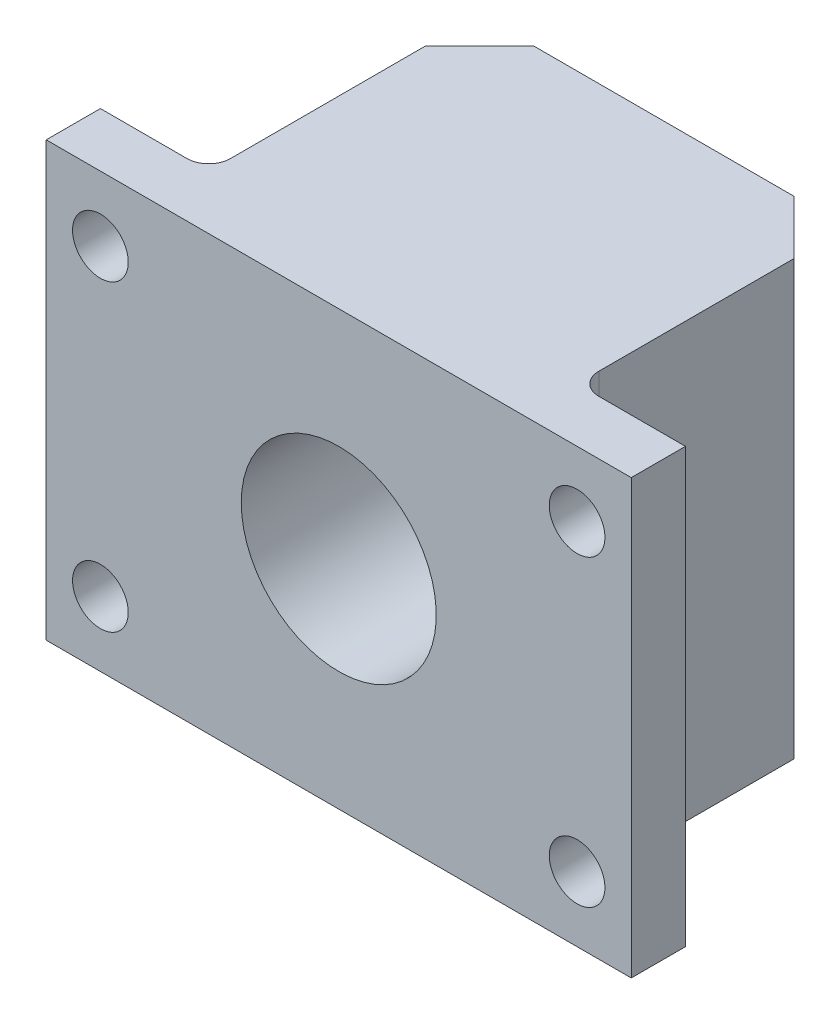
ISO-10303-21;
HEADER;
FILE_DESCRIPTION(('STEP AP214'),'2;1');
FILE_NAME('part.step','',(''),(''),'','','');
FILE_SCHEMA(('AUTOMOTIVE_DESIGN { 1 0 10303 214 1 1 1 1 }'));
ENDSEC;
DATA;
#1=APPLICATION_CONTEXT('core data for automotive mechanical design processes');
#2=APPLICATION_PROTOCOL_DEFINITION('international standard','automotive_design',2000,#1);
#3=PRODUCT_CONTEXT('',#1,'mechanical');
#4=PRODUCT('Part','Part','',(#3));
#5=PRODUCT_RELATED_PRODUCT_CATEGORY('part','',(#4));
#6=PRODUCT_DEFINITION_FORMATION('','',#4);
#7=PRODUCT_DEFINITION_CONTEXT('part definition',#1,'design');
#8=PRODUCT_DEFINITION('design','',#6,#7);
#9=PRODUCT_DEFINITION_SHAPE('','',#8);
#10=(LENGTH_UNIT() NAMED_UNIT(*) SI_UNIT(.MILLI.,.METRE.));
#11=(NAMED_UNIT(*) PLANE_ANGLE_UNIT() SI_UNIT($,.RADIAN.));
#12=(NAMED_UNIT(*) SI_UNIT($,.STERADIAN.) SOLID_ANGLE_UNIT());
#13=UNCERTAINTY_MEASURE_WITH_UNIT(LENGTH_MEASURE(1.E-05),#10,'distance_accuracy_value','');
#14=(GEOMETRIC_REPRESENTATION_CONTEXT(3) GLOBAL_UNCERTAINTY_ASSIGNED_CONTEXT((#13)) GLOBAL_UNIT_ASSIGNED_CONTEXT((#10,
#11,#12)) REPRESENTATION_CONTEXT('',''));
#15=CARTESIAN_POINT('',(0.,0.,0.));
#16=DIRECTION('',(0.,0.,1.));
#17=DIRECTION('',(1.,0.,0.));
#18=AXIS2_PLACEMENT_3D('',#15,#16,#17);
#19=CARTESIAN_POINT('',(17.145,25.4,-3.175));
#20=DIRECTION('',(-1.,0.,0.));
#21=DIRECTION('',(0.,0.,1.));
#22=AXIS2_PLACEMENT_3D('',#19,#20,#21);
#23=PLANE('',#22);
#24=DIRECTION('',(0.,0.,-1.));
#25=VECTOR('',#24,1.);
#26=CARTESIAN_POINT('',(17.145,0.,-3.175));
#27=LINE('',#26,#25);
#28=CARTESIAN_POINT('',(17.145,0.,0.));
#29=VERTEX_POINT('',#28);
#30=CARTESIAN_POINT('',(17.145,0.,-3.175));
#31=VERTEX_POINT('',#30);
#32=EDGE_CURVE('E173',#29,#31,#27,.T.);
#33=ORIENTED_EDGE('',*,*,#32,.T.);
#34=DIRECTION('',(0.,-1.,0.));
#35=VECTOR('',#34,1.);
#36=CARTESIAN_POINT('',(17.145,25.4,-3.175));
#37=LINE('',#36,#35);
#38=CARTESIAN_POINT('',(17.145,25.4,-3.175));
#39=VERTEX_POINT('',#38);
#40=EDGE_CURVE('E153',#39,#31,#37,.T.);
#41=ORIENTED_EDGE('',*,*,#40,.F.);
#42=DIRECTION('',(0.,0.,-1.));
#43=VECTOR('',#42,1.);
#44=CARTESIAN_POINT('',(17.145,25.4,-3.175));
#45=LINE('',#44,#43);
#46=CARTESIAN_POINT('',(17.145,25.4,0.));
#47=VERTEX_POINT('',#46);
#48=EDGE_CURVE('E137',#47,#39,#45,.T.);
#49=ORIENTED_EDGE('',*,*,#48,.F.);
#50=DIRECTION('',(0.,-1.,0.));
#51=VECTOR('',#50,1.);
#52=CARTESIAN_POINT('',(17.145,25.4,0.));
#53=LINE('',#52,#51);
#54=EDGE_CURVE('E147',#47,#29,#53,.T.);
#55=ORIENTED_EDGE('',*,*,#54,.T.);
#56=EDGE_LOOP('',(#33,#41,#49,#55));
#57=FACE_BOUND('',#56,.T.);
#58=ADVANCED_FACE('F45',(#57),#23,.F.);
#59=CARTESIAN_POINT('',(10.795,25.4,-3.175));
#60=DIRECTION('',(0.,0.,1.));
#61=DIRECTION('',(1.,0.,0.));
#62=AXIS2_PLACEMENT_3D('',#59,#60,#61);
#63=PLANE('',#62);
#64=CARTESIAN_POINT('',(13.97,3.81,-3.175));
#65=DIRECTION('',(0.,0.,-1.));
#66=DIRECTION('',(1.,0.,0.));
#67=AXIS2_PLACEMENT_3D('',#64,#65,#66);
#68=CIRCLE('',#67,1.63195);
#69=CARTESIAN_POINT('',(15.60195,3.81,-3.175));
#70=VERTEX_POINT('',#69);
#71=EDGE_CURVE('E456',#70,#70,#68,.T.);
#72=ORIENTED_EDGE('',*,*,#71,.F.);
#73=EDGE_LOOP('',(#72));
#74=FACE_BOUND('',#73,.T.);
#75=CARTESIAN_POINT('',(13.97,21.59,-3.175));
#76=DIRECTION('',(0.,0.,-1.));
#77=DIRECTION('',(-1.,0.,0.));
#78=AXIS2_PLACEMENT_3D('',#75,#76,#77);
#79=CIRCLE('',#78,1.63195);
#80=CARTESIAN_POINT('',(12.33805,21.59,-3.175));
#81=VERTEX_POINT('',#80);
#82=EDGE_CURVE('E460',#81,#81,#79,.T.);
#83=ORIENTED_EDGE('',*,*,#82,.F.);
#84=EDGE_LOOP('',(#83));
#85=FACE_BOUND('',#84,.T.);
#86=DIRECTION('',(-1.,0.,0.));
#87=VECTOR('',#86,1.);
#88=CARTESIAN_POINT('',(10.795,0.,-3.175));
#89=LINE('',#88,#87);
#90=CARTESIAN_POINT('',(12.065,0.,-3.175));
#91=VERTEX_POINT('',#90);
#92=EDGE_CURVE('E175',#31,#91,#89,.T.);
#93=ORIENTED_EDGE('',*,*,#92,.T.);
#94=DIRECTION('',(0.,-1.,0.));
#95=VECTOR('',#94,1.);
#96=CARTESIAN_POINT('',(12.065,25.4,-3.175));
#97=LINE('',#96,#95);
#98=CARTESIAN_POINT('',(12.065,25.4,-3.175));
#99=VERTEX_POINT('',#98);
#100=EDGE_CURVE('E60',#91,#99,#97,.F.);
#101=ORIENTED_EDGE('',*,*,#100,.T.);
#102=DIRECTION('',(-1.,0.,0.));
#103=VECTOR('',#102,1.);
#104=CARTESIAN_POINT('',(10.795,25.4,-3.175));
#105=LINE('',#104,#103);
#106=EDGE_CURVE('E156',#39,#99,#105,.T.);
#107=ORIENTED_EDGE('',*,*,#106,.F.);
#108=ORIENTED_EDGE('',*,*,#40,.T.);
#109=EDGE_LOOP('',(#93,#101,#107,#108));
#110=FACE_BOUND('',#109,.T.);
#111=ADVANCED_FACE('F263',(#74,#85,#110),#63,.F.);
#112=CARTESIAN_POINT('',(10.795,25.4,-19.05));
#113=DIRECTION('',(-1.,0.,0.));
#114=DIRECTION('',(0.,0.,1.));
#115=AXIS2_PLACEMENT_3D('',#112,#113,#114);
#116=PLANE('',#115);
#117=DIRECTION('',(0.,0.,-1.));
#118=VECTOR('',#117,1.);
#119=CARTESIAN_POINT('',(10.795,25.4,-19.05));
#120=LINE('',#119,#118);
#121=CARTESIAN_POINT('',(10.795,25.4,-4.445));
#122=VERTEX_POINT('',#121);
#123=CARTESIAN_POINT('',(10.795,25.4,-15.875));
#124=VERTEX_POINT('',#123);
#125=EDGE_CURVE('E158',#122,#124,#120,.T.);
#126=ORIENTED_EDGE('',*,*,#125,.F.);
#127=DIRECTION('',(0.,-1.,0.));
#128=VECTOR('',#127,1.);
#129=CARTESIAN_POINT('',(10.795,0.,-4.445));
#130=LINE('',#129,#128);
#131=CARTESIAN_POINT('',(10.795,0.,-4.445));
#132=VERTEX_POINT('',#131);
#133=EDGE_CURVE('E220',#122,#132,#130,.T.);
#134=ORIENTED_EDGE('',*,*,#133,.T.);
#135=DIRECTION('',(0.,0.,-1.));
#136=VECTOR('',#135,1.);
#137=CARTESIAN_POINT('',(10.795,0.,-19.05));
#138=LINE('',#137,#136);
#139=CARTESIAN_POINT('',(10.795,0.,-15.875));
#140=VERTEX_POINT('',#139);
#141=EDGE_CURVE('E178',#132,#140,#138,.T.);
#142=ORIENTED_EDGE('',*,*,#141,.T.);
#143=DIRECTION('',(0.,1.,0.));
#144=VECTOR('',#143,1.);
#145=CARTESIAN_POINT('',(10.795,25.4,-15.875));
#146=LINE('',#145,#144);
#147=EDGE_CURVE('E205',#140,#124,#146,.T.);
#148=ORIENTED_EDGE('',*,*,#147,.T.);
#149=EDGE_LOOP('',(#126,#134,#142,#148));
#150=FACE_BOUND('',#149,.T.);
#151=ADVANCED_FACE('F259',(#150),#116,.F.);
#152=CARTESIAN_POINT('',(-10.795,25.4,-19.05));
#153=DIRECTION('',(0.,0.,1.));
#154=DIRECTION('',(1.,0.,0.));
#155=AXIS2_PLACEMENT_3D('',#152,#153,#154);
#156=PLANE('',#155);
#157=CARTESIAN_POINT('',(0.,12.7,-19.05));
#158=DIRECTION('',(0.,0.,-1.));
#159=DIRECTION('',(-1.,0.,0.));
#160=AXIS2_PLACEMENT_3D('',#157,#158,#159);
#161=CIRCLE('',#160,5.715);
#162=CARTESIAN_POINT('',(-5.715,12.7,-19.05));
#163=VERTEX_POINT('',#162);
#164=EDGE_CURVE('E446',#163,#163,#161,.T.);
#165=ORIENTED_EDGE('',*,*,#164,.F.);
#166=EDGE_LOOP('',(#165));
#167=FACE_BOUND('',#166,.T.);
#168=DIRECTION('',(-1.,0.,0.));
#169=VECTOR('',#168,1.);
#170=CARTESIAN_POINT('',(-10.795,25.4,-19.05));
#171=LINE('',#170,#169);
#172=CARTESIAN_POINT('',(7.61999999999999,25.4,-19.05));
#173=VERTEX_POINT('',#172);
#174=CARTESIAN_POINT('',(-7.61999999999999,25.4,-19.05));
#175=VERTEX_POINT('',#174);
#176=EDGE_CURVE('E163',#173,#175,#171,.T.);
#177=ORIENTED_EDGE('',*,*,#176,.F.);
#178=DIRECTION('',(0.,-1.,0.));
#179=VECTOR('',#178,1.);
#180=CARTESIAN_POINT('',(7.61999999999999,25.4,-19.05));
#181=LINE('',#180,#179);
#182=CARTESIAN_POINT('',(7.61999999999999,0.,-19.05));
#183=VERTEX_POINT('',#182);
#184=EDGE_CURVE('E197',#173,#183,#181,.T.);
#185=ORIENTED_EDGE('',*,*,#184,.T.);
#186=DIRECTION('',(-1.,0.,0.));
#187=VECTOR('',#186,1.);
#188=CARTESIAN_POINT('',(-10.795,0.,-19.05));
#189=LINE('',#188,#187);
#190=CARTESIAN_POINT('',(-7.61999999999999,0.,-19.05));
#191=VERTEX_POINT('',#190);
#192=EDGE_CURVE('E180',#183,#191,#189,.T.);
#193=ORIENTED_EDGE('',*,*,#192,.T.);
#194=DIRECTION('',(0.,1.,0.));
#195=VECTOR('',#194,1.);
#196=CARTESIAN_POINT('',(-7.61999999999999,25.4,-19.05));
#197=LINE('',#196,#195);
#198=EDGE_CURVE('E152',#191,#175,#197,.T.);
#199=ORIENTED_EDGE('',*,*,#198,.T.);
#200=EDGE_LOOP('',(#177,#185,#193,#199));
#201=FACE_BOUND('',#200,.T.);
#202=ADVANCED_FACE('F251',(#167,#201),#156,.F.);
#203=CARTESIAN_POINT('',(-10.795,25.4,-19.05));
#204=DIRECTION('',(1.,0.,0.));
#205=DIRECTION('',(0.,0.,-1.));
#206=AXIS2_PLACEMENT_3D('',#203,#204,#205);
#207=PLANE('',#206);
#208=DIRECTION('',(0.,0.,1.));
#209=VECTOR('',#208,1.);
#210=CARTESIAN_POINT('',(-10.795,0.,-19.05));
#211=LINE('',#210,#209);
#212=CARTESIAN_POINT('',(-10.795,0.,-15.875));
#213=VERTEX_POINT('',#212);
#214=CARTESIAN_POINT('',(-10.795,0.,-4.445));
#215=VERTEX_POINT('',#214);
#216=EDGE_CURVE('E183',#213,#215,#211,.T.);
#217=ORIENTED_EDGE('',*,*,#216,.T.);
#218=DIRECTION('',(0.,-1.,0.));
#219=VECTOR('',#218,1.);
#220=CARTESIAN_POINT('',(-10.795,25.4,-4.445));
#221=LINE('',#220,#219);
#222=CARTESIAN_POINT('',(-10.795,25.4,-4.445));
#223=VERTEX_POINT('',#222);
#224=EDGE_CURVE('E218',#215,#223,#221,.F.);
#225=ORIENTED_EDGE('',*,*,#224,.T.);
#226=DIRECTION('',(0.,0.,1.));
#227=VECTOR('',#226,1.);
#228=CARTESIAN_POINT('',(-10.795,25.4,-19.05));
#229=LINE('',#228,#227);
#230=CARTESIAN_POINT('',(-10.795,25.4,-15.875));
#231=VERTEX_POINT('',#230);
#232=EDGE_CURVE('E166',#231,#223,#229,.T.);
#233=ORIENTED_EDGE('',*,*,#232,.F.);
#234=DIRECTION('',(0.,-1.,0.));
#235=VECTOR('',#234,1.);
#236=CARTESIAN_POINT('',(-10.795,25.4,-15.875));
#237=LINE('',#236,#235);
#238=EDGE_CURVE('E212',#231,#213,#237,.T.);
#239=ORIENTED_EDGE('',*,*,#238,.T.);
#240=EDGE_LOOP('',(#217,#225,#233,#239));
#241=FACE_BOUND('',#240,.T.);
#242=ADVANCED_FACE('F243',(#241),#207,.F.);
#243=CARTESIAN_POINT('',(-10.795,25.4,-3.175));
#244=DIRECTION('',(0.,0.,1.));
#245=DIRECTION('',(1.,0.,0.));
#246=AXIS2_PLACEMENT_3D('',#243,#244,#245);
#247=PLANE('',#246);
#248=CARTESIAN_POINT('',(-13.97,21.59,-3.175));
#249=DIRECTION('',(0.,0.,-1.));
#250=DIRECTION('',(1.,0.,0.));
#251=AXIS2_PLACEMENT_3D('',#248,#249,#250);
#252=CIRCLE('',#251,1.63195);
#253=CARTESIAN_POINT('',(-12.33805,21.59,-3.175));
#254=VERTEX_POINT('',#253);
#255=EDGE_CURVE('E464',#254,#254,#252,.T.);
#256=ORIENTED_EDGE('',*,*,#255,.F.);
#257=EDGE_LOOP('',(#256));
#258=FACE_BOUND('',#257,.T.);
#259=CARTESIAN_POINT('',(-13.97,3.81,-3.175));
#260=DIRECTION('',(0.,0.,-1.));
#261=DIRECTION('',(-1.,0.,0.));
#262=AXIS2_PLACEMENT_3D('',#259,#260,#261);
#263=CIRCLE('',#262,1.63195);
#264=CARTESIAN_POINT('',(-15.60195,3.81,-3.17500000000001));
#265=VERTEX_POINT('',#264);
#266=EDGE_CURVE('E457',#265,#265,#263,.T.);
#267=ORIENTED_EDGE('',*,*,#266,.F.);
#268=EDGE_LOOP('',(#267));
#269=FACE_BOUND('',#268,.T.);
#270=DIRECTION('',(-1.,0.,0.));
#271=VECTOR('',#270,1.);
#272=CARTESIAN_POINT('',(-10.795,25.4,-3.175));
#273=LINE('',#272,#271);
#274=CARTESIAN_POINT('',(-12.065,25.4,-3.175));
#275=VERTEX_POINT('',#274);
#276=CARTESIAN_POINT('',(-17.145,25.4,-3.175));
#277=VERTEX_POINT('',#276);
#278=EDGE_CURVE('E169',#275,#277,#273,.T.);
#279=ORIENTED_EDGE('',*,*,#278,.F.);
#280=DIRECTION('',(0.,-1.,0.));
#281=VECTOR('',#280,1.);
#282=CARTESIAN_POINT('',(-12.065,0.,-3.175));
#283=LINE('',#282,#281);
#284=CARTESIAN_POINT('',(-12.065,0.,-3.175));
#285=VERTEX_POINT('',#284);
#286=EDGE_CURVE('E215',#275,#285,#283,.T.);
#287=ORIENTED_EDGE('',*,*,#286,.T.);
#288=DIRECTION('',(-1.,0.,0.));
#289=VECTOR('',#288,1.);
#290=CARTESIAN_POINT('',(-10.795,0.,-3.175));
#291=LINE('',#290,#289);
#292=CARTESIAN_POINT('',(-17.145,0.,-3.175));
#293=VERTEX_POINT('',#292);
#294=EDGE_CURVE('E186',#285,#293,#291,.T.);
#295=ORIENTED_EDGE('',*,*,#294,.T.);
#296=DIRECTION('',(0.,-1.,0.));
#297=VECTOR('',#296,1.);
#298=CARTESIAN_POINT('',(-17.145,25.4,-3.175));
#299=LINE('',#298,#297);
#300=EDGE_CURVE('E192',#277,#293,#299,.T.);
#301=ORIENTED_EDGE('',*,*,#300,.F.);
#302=EDGE_LOOP('',(#279,#287,#295,#301));
#303=FACE_BOUND('',#302,.T.);
#304=ADVANCED_FACE('F235',(#258,#269,#303),#247,.F.);
#305=CARTESIAN_POINT('',(-17.145,25.4,-3.175));
#306=DIRECTION('',(1.,0.,0.));
#307=DIRECTION('',(0.,0.,-1.));
#308=AXIS2_PLACEMENT_3D('',#305,#306,#307);
#309=PLANE('',#308);
#310=DIRECTION('',(0.,0.,1.));
#311=VECTOR('',#310,1.);
#312=CARTESIAN_POINT('',(-17.145,0.,-3.175));
#313=LINE('',#312,#311);
#314=CARTESIAN_POINT('',(-17.145,0.,0.));
#315=VERTEX_POINT('',#314);
#316=EDGE_CURVE('E188',#293,#315,#313,.T.);
#317=ORIENTED_EDGE('',*,*,#316,.T.);
#318=DIRECTION('',(0.,-1.,0.));
#319=VECTOR('',#318,1.);
#320=CARTESIAN_POINT('',(-17.145,25.4,0.));
#321=LINE('',#320,#319);
#322=CARTESIAN_POINT('',(-17.145,25.4,0.));
#323=VERTEX_POINT('',#322);
#324=EDGE_CURVE('E172',#323,#315,#321,.T.);
#325=ORIENTED_EDGE('',*,*,#324,.F.);
#326=DIRECTION('',(0.,0.,1.));
#327=VECTOR('',#326,1.);
#328=CARTESIAN_POINT('',(-17.145,25.4,-3.175));
#329=LINE('',#328,#327);
#330=EDGE_CURVE('E140',#277,#323,#329,.T.);
#331=ORIENTED_EDGE('',*,*,#330,.F.);
#332=ORIENTED_EDGE('',*,*,#300,.T.);
#333=EDGE_LOOP('',(#317,#325,#331,#332));
#334=FACE_BOUND('',#333,.T.);
#335=ADVANCED_FACE('F265',(#334),#309,.F.);
#336=CARTESIAN_POINT('',(-17.145,25.4,0.));
#337=DIRECTION('',(0.,0.,-1.));
#338=DIRECTION('',(-1.,0.,0.));
#339=AXIS2_PLACEMENT_3D('',#336,#337,#338);
#340=PLANE('',#339);
#341=CARTESIAN_POINT('',(0.,12.7,0.));
#342=DIRECTION('',(0.,0.,-1.));
#343=DIRECTION('',(-1.,0.,0.));
#344=AXIS2_PLACEMENT_3D('',#341,#342,#343);
#345=CIRCLE('',#344,5.715);
#346=CARTESIAN_POINT('',(-5.715,12.7,0.));
#347=VERTEX_POINT('',#346);
#348=EDGE_CURVE('E447',#347,#347,#345,.T.);
#349=ORIENTED_EDGE('',*,*,#348,.T.);
#350=EDGE_LOOP('',(#349));
#351=FACE_BOUND('',#350,.T.);
#352=CARTESIAN_POINT('',(-13.97,21.59,0.));
#353=DIRECTION('',(0.,0.,-1.));
#354=DIRECTION('',(-1.,0.,0.));
#355=AXIS2_PLACEMENT_3D('',#352,#353,#354);
#356=CIRCLE('',#355,1.63195);
#357=CARTESIAN_POINT('',(-15.60195,21.59,0.));
#358=VERTEX_POINT('',#357);
#359=EDGE_CURVE('E450',#358,#358,#356,.F.);
#360=ORIENTED_EDGE('',*,*,#359,.F.);
#361=EDGE_LOOP('',(#360));
#362=FACE_BOUND('',#361,.T.);
#363=CARTESIAN_POINT('',(-13.97,3.81,0.));
#364=DIRECTION('',(0.,0.,-1.));
#365=DIRECTION('',(-1.,0.,0.));
#366=AXIS2_PLACEMENT_3D('',#363,#364,#365);
#367=CIRCLE('',#366,1.63195);
#368=CARTESIAN_POINT('',(-15.60195,3.81,0.));
#369=VERTEX_POINT('',#368);
#370=EDGE_CURVE('E461',#369,#369,#367,.F.);
#371=ORIENTED_EDGE('',*,*,#370,.F.);
#372=EDGE_LOOP('',(#371));
#373=FACE_BOUND('',#372,.T.);
#374=CARTESIAN_POINT('',(13.97,3.81,0.));
#375=DIRECTION('',(0.,0.,-1.));
#376=DIRECTION('',(-1.,0.,0.));
#377=AXIS2_PLACEMENT_3D('',#374,#375,#376);
#378=CIRCLE('',#377,1.63195);
#379=CARTESIAN_POINT('',(12.33805,3.81,0.));
#380=VERTEX_POINT('',#379);
#381=EDGE_CURVE('E453',#380,#380,#378,.F.);
#382=ORIENTED_EDGE('',*,*,#381,.F.);
#383=EDGE_LOOP('',(#382));
#384=FACE_BOUND('',#383,.T.);
#385=CARTESIAN_POINT('',(13.97,21.59,0.));
#386=DIRECTION('',(0.,0.,-1.));
#387=DIRECTION('',(-1.,0.,0.));
#388=AXIS2_PLACEMENT_3D('',#385,#386,#387);
#389=CIRCLE('',#388,1.63195);
#390=CARTESIAN_POINT('',(12.33805,21.59,0.));
#391=VERTEX_POINT('',#390);
#392=EDGE_CURVE('E176',#391,#391,#389,.F.);
#393=ORIENTED_EDGE('',*,*,#392,.F.);
#394=EDGE_LOOP('',(#393));
#395=FACE_BOUND('',#394,.T.);
#396=DIRECTION('',(1.,0.,0.));
#397=VECTOR('',#396,1.);
#398=CARTESIAN_POINT('',(-17.145,0.,0.));
#399=LINE('',#398,#397);
#400=EDGE_CURVE('E144',#315,#29,#399,.T.);
#401=ORIENTED_EDGE('',*,*,#400,.T.);
#402=ORIENTED_EDGE('',*,*,#54,.F.);
#403=DIRECTION('',(1.,0.,0.));
#404=VECTOR('',#403,1.);
#405=CARTESIAN_POINT('',(-12.7,25.4,0.));
#406=LINE('',#405,#404);
#407=EDGE_CURVE('E133',#323,#47,#406,.T.);
#408=ORIENTED_EDGE('',*,*,#407,.F.);
#409=ORIENTED_EDGE('',*,*,#324,.T.);
#410=EDGE_LOOP('',(#401,#402,#408,#409));
#411=FACE_BOUND('',#410,.T.);
#412=ADVANCED_FACE('F148',(#351,#362,#373,#384,#395,#411),#340,.F.);
#413=CARTESIAN_POINT('',(0.,25.4,0.));
#414=DIRECTION('',(0.,-1.,0.));
#415=DIRECTION('',(0.,0.,-1.));
#416=AXIS2_PLACEMENT_3D('',#413,#414,#415);
#417=PLANE('',#416);
#418=ORIENTED_EDGE('',*,*,#106,.T.);
#419=CARTESIAN_POINT('',(12.065,25.4,-4.445));
#420=DIRECTION('',(0.,-1.,0.));
#421=DIRECTION('',(0.,0.,-1.));
#422=AXIS2_PLACEMENT_3D('',#419,#420,#421);
#423=CIRCLE('',#422,1.27);
#424=EDGE_CURVE('E11',#99,#122,#423,.T.);
#425=ORIENTED_EDGE('',*,*,#424,.T.);
#426=ORIENTED_EDGE('',*,*,#125,.T.);
#427=DIRECTION('',(0.707106781186548,0.,0.707106781186548));
#428=VECTOR('',#427,1.);
#429=CARTESIAN_POINT('',(7.61999999999999,25.4,-19.05));
#430=LINE('',#429,#428);
#431=EDGE_CURVE('E210',#124,#173,#430,.F.);
#432=ORIENTED_EDGE('',*,*,#431,.T.);
#433=ORIENTED_EDGE('',*,*,#176,.T.);
#434=DIRECTION('',(0.707106781186548,0.,-0.707106781186547));
#435=VECTOR('',#434,1.);
#436=CARTESIAN_POINT('',(-10.795,25.4,-15.875));
#437=LINE('',#436,#435);
#438=EDGE_CURVE('E208',#175,#231,#437,.F.);
#439=ORIENTED_EDGE('',*,*,#438,.T.);
#440=ORIENTED_EDGE('',*,*,#232,.T.);
#441=CARTESIAN_POINT('',(-12.065,25.4,-4.445));
#442=DIRECTION('',(0.,-1.,0.));
#443=DIRECTION('',(0.,0.,-1.));
#444=AXIS2_PLACEMENT_3D('',#441,#442,#443);
#445=CIRCLE('',#444,1.27);
#446=EDGE_CURVE('E226',#223,#275,#445,.T.);
#447=ORIENTED_EDGE('',*,*,#446,.T.);
#448=ORIENTED_EDGE('',*,*,#278,.T.);
#449=ORIENTED_EDGE('',*,*,#330,.T.);
#450=ORIENTED_EDGE('',*,*,#407,.T.);
#451=ORIENTED_EDGE('',*,*,#48,.T.);
#452=EDGE_LOOP('',(#418,#425,#426,#432,#433,#439,#440,#447,#448,#449,#450,#451));
#453=FACE_BOUND('',#452,.T.);
#454=ADVANCED_FACE('F135',(#453),#417,.F.);
#455=CARTESIAN_POINT('',(0.,0.,0.));
#456=DIRECTION('',(0.,-1.,0.));
#457=DIRECTION('',(0.,0.,-1.));
#458=AXIS2_PLACEMENT_3D('',#455,#456,#457);
#459=PLANE('',#458);
#460=ORIENTED_EDGE('',*,*,#192,.F.);
#461=DIRECTION('',(-0.707106781186548,0.,-0.707106781186548));
#462=VECTOR('',#461,1.);
#463=CARTESIAN_POINT('',(13.335,0.,-13.335));
#464=LINE('',#463,#462);
#465=EDGE_CURVE('E202',#183,#140,#464,.F.);
#466=ORIENTED_EDGE('',*,*,#465,.T.);
#467=ORIENTED_EDGE('',*,*,#141,.F.);
#468=CARTESIAN_POINT('',(12.065,0.,-4.445));
#469=DIRECTION('',(0.,-1.,0.));
#470=DIRECTION('',(0.,0.,-1.));
#471=AXIS2_PLACEMENT_3D('',#468,#469,#470);
#472=CIRCLE('',#471,1.27);
#473=EDGE_CURVE('E53',#132,#91,#472,.F.);
#474=ORIENTED_EDGE('',*,*,#473,.T.);
#475=ORIENTED_EDGE('',*,*,#92,.F.);
#476=ORIENTED_EDGE('',*,*,#32,.F.);
#477=ORIENTED_EDGE('',*,*,#400,.F.);
#478=ORIENTED_EDGE('',*,*,#316,.F.);
#479=ORIENTED_EDGE('',*,*,#294,.F.);
#480=CARTESIAN_POINT('',(-12.065,0.,-4.445));
#481=DIRECTION('',(0.,-1.,0.));
#482=DIRECTION('',(0.,0.,-1.));
#483=AXIS2_PLACEMENT_3D('',#480,#481,#482);
#484=CIRCLE('',#483,1.27);
#485=EDGE_CURVE('E224',#285,#215,#484,.F.);
#486=ORIENTED_EDGE('',*,*,#485,.T.);
#487=ORIENTED_EDGE('',*,*,#216,.F.);
#488=DIRECTION('',(-0.707106781186548,0.,0.707106781186547));
#489=VECTOR('',#488,1.);
#490=CARTESIAN_POINT('',(-13.335,0.,-13.335));
#491=LINE('',#490,#489);
#492=EDGE_CURVE('E200',#213,#191,#491,.F.);
#493=ORIENTED_EDGE('',*,*,#492,.T.);
#494=EDGE_LOOP('',(#460,#466,#467,#474,#475,#476,#477,#478,#479,#486,#487,#493));
#495=FACE_BOUND('',#494,.T.);
#496=ADVANCED_FACE('F240',(#495),#459,.T.);
#497=CARTESIAN_POINT('',(7.61999999999999,25.4,-19.05));
#498=DIRECTION('',(-0.707106781186548,0.,0.707106781186548));
#499=DIRECTION('',(0.,-1.,0.));
#500=AXIS2_PLACEMENT_3D('',#497,#498,#499);
#501=PLANE('',#500);
#502=ORIENTED_EDGE('',*,*,#431,.F.);
#503=ORIENTED_EDGE('',*,*,#147,.F.);
#504=ORIENTED_EDGE('',*,*,#465,.F.);
#505=ORIENTED_EDGE('',*,*,#184,.F.);
#506=EDGE_LOOP('',(#502,#503,#504,#505));
#507=FACE_BOUND('',#506,.T.);
#508=ADVANCED_FACE('F255',(#507),#501,.F.);
#509=CARTESIAN_POINT('',(-10.795,25.4,-15.875));
#510=DIRECTION('',(0.707106781186547,0.,0.707106781186548));
#511=DIRECTION('',(0.,-1.,0.));
#512=AXIS2_PLACEMENT_3D('',#509,#510,#511);
#513=PLANE('',#512);
#514=ORIENTED_EDGE('',*,*,#438,.F.);
#515=ORIENTED_EDGE('',*,*,#198,.F.);
#516=ORIENTED_EDGE('',*,*,#492,.F.);
#517=ORIENTED_EDGE('',*,*,#238,.F.);
#518=EDGE_LOOP('',(#514,#515,#516,#517));
#519=FACE_BOUND('',#518,.T.);
#520=ADVANCED_FACE('F247',(#519),#513,.F.);
#521=CARTESIAN_POINT('',(13.97,21.59,4.61585164622956));
#522=DIRECTION('',(0.,0.,-1.));
#523=DIRECTION('',(-1.,0.,0.));
#524=AXIS2_PLACEMENT_3D('',#521,#522,#523);
#525=CYLINDRICAL_SURFACE('',#524,1.63195);
#526=ORIENTED_EDGE('',*,*,#392,.T.);
#527=EDGE_LOOP('',(#526));
#528=FACE_BOUND('',#527,.T.);
#529=ORIENTED_EDGE('',*,*,#82,.T.);
#530=EDGE_LOOP('',(#529));
#531=FACE_BOUND('',#530,.T.);
#532=ADVANCED_FACE('F294',(#528,#531),#525,.F.);
#533=CARTESIAN_POINT('',(13.97,3.81,4.61585164622956));
#534=DIRECTION('',(0.,0.,-1.));
#535=DIRECTION('',(-1.,0.,0.));
#536=AXIS2_PLACEMENT_3D('',#533,#534,#535);
#537=CYLINDRICAL_SURFACE('',#536,1.63195);
#538=ORIENTED_EDGE('',*,*,#381,.T.);
#539=EDGE_LOOP('',(#538));
#540=FACE_BOUND('',#539,.T.);
#541=ORIENTED_EDGE('',*,*,#71,.T.);
#542=EDGE_LOOP('',(#541));
#543=FACE_BOUND('',#542,.T.);
#544=ADVANCED_FACE('F314',(#540,#543),#537,.F.);
#545=CARTESIAN_POINT('',(-13.97,3.81,4.61585164622955));
#546=DIRECTION('',(0.,0.,-1.));
#547=DIRECTION('',(-1.,0.,0.));
#548=AXIS2_PLACEMENT_3D('',#545,#546,#547);
#549=CYLINDRICAL_SURFACE('',#548,1.63195);
#550=ORIENTED_EDGE('',*,*,#370,.T.);
#551=EDGE_LOOP('',(#550));
#552=FACE_BOUND('',#551,.T.);
#553=ORIENTED_EDGE('',*,*,#266,.T.);
#554=EDGE_LOOP('',(#553));
#555=FACE_BOUND('',#554,.T.);
#556=ADVANCED_FACE('F308',(#552,#555),#549,.F.);
#557=CARTESIAN_POINT('',(-13.97,21.59,4.61585164622955));
#558=DIRECTION('',(0.,0.,-1.));
#559=DIRECTION('',(-1.,0.,0.));
#560=AXIS2_PLACEMENT_3D('',#557,#558,#559);
#561=CYLINDRICAL_SURFACE('',#560,1.63195);
#562=ORIENTED_EDGE('',*,*,#359,.T.);
#563=EDGE_LOOP('',(#562));
#564=FACE_BOUND('',#563,.T.);
#565=ORIENTED_EDGE('',*,*,#255,.T.);
#566=EDGE_LOOP('',(#565));
#567=FACE_BOUND('',#566,.T.);
#568=ADVANCED_FACE('F302',(#564,#567),#561,.F.);
#569=CARTESIAN_POINT('',(0.,12.7,0.));
#570=DIRECTION('',(0.,0.,-1.));
#571=DIRECTION('',(-1.,0.,0.));
#572=AXIS2_PLACEMENT_3D('',#569,#570,#571);
#573=CYLINDRICAL_SURFACE('',#572,5.715);
#574=ORIENTED_EDGE('',*,*,#348,.F.);
#575=EDGE_LOOP('',(#574));
#576=FACE_BOUND('',#575,.T.);
#577=ORIENTED_EDGE('',*,*,#164,.T.);
#578=EDGE_LOOP('',(#577));
#579=FACE_BOUND('',#578,.T.);
#580=ADVANCED_FACE('F296',(#576,#579),#573,.F.);
#581=CARTESIAN_POINT('',(-12.065,25.4,-4.445));
#582=DIRECTION('',(0.,1.,0.));
#583=DIRECTION('',(0.,0.,1.));
#584=AXIS2_PLACEMENT_3D('',#581,#582,#583);
#585=CYLINDRICAL_SURFACE('',#584,1.27);
#586=ORIENTED_EDGE('',*,*,#446,.F.);
#587=ORIENTED_EDGE('',*,*,#224,.F.);
#588=ORIENTED_EDGE('',*,*,#485,.F.);
#589=ORIENTED_EDGE('',*,*,#286,.F.);
#590=EDGE_LOOP('',(#586,#587,#588,#589));
#591=FACE_BOUND('',#590,.T.);
#592=ADVANCED_FACE('F237',(#591),#585,.F.);
#593=CARTESIAN_POINT('',(12.065,25.4,-4.445));
#594=DIRECTION('',(0.,1.,0.));
#595=DIRECTION('',(0.,0.,1.));
#596=AXIS2_PLACEMENT_3D('',#593,#594,#595);
#597=CYLINDRICAL_SURFACE('',#596,1.27);
#598=ORIENTED_EDGE('',*,*,#424,.F.);
#599=ORIENTED_EDGE('',*,*,#100,.F.);
#600=ORIENTED_EDGE('',*,*,#473,.F.);
#601=ORIENTED_EDGE('',*,*,#133,.F.);
#602=EDGE_LOOP('',(#598,#599,#600,#601));
#603=FACE_BOUND('',#602,.T.);
#604=ADVANCED_FACE('F47',(#603),#597,.F.);
#605=CLOSED_SHELL('',(#58,#111,#151,#202,#242,#304,#335,#412,#454,#496,#508,#520,#532,#544,#556,
#568,#580,#592,#604));
#606=MANIFOLD_SOLID_BREP('B2',#605);
#607=ADVANCED_BREP_SHAPE_REPRESENTATION('',(#18,#606),#14);
#608=SHAPE_DEFINITION_REPRESENTATION(#9,#607);
ENDSEC;
END-ISO-10303-21;
